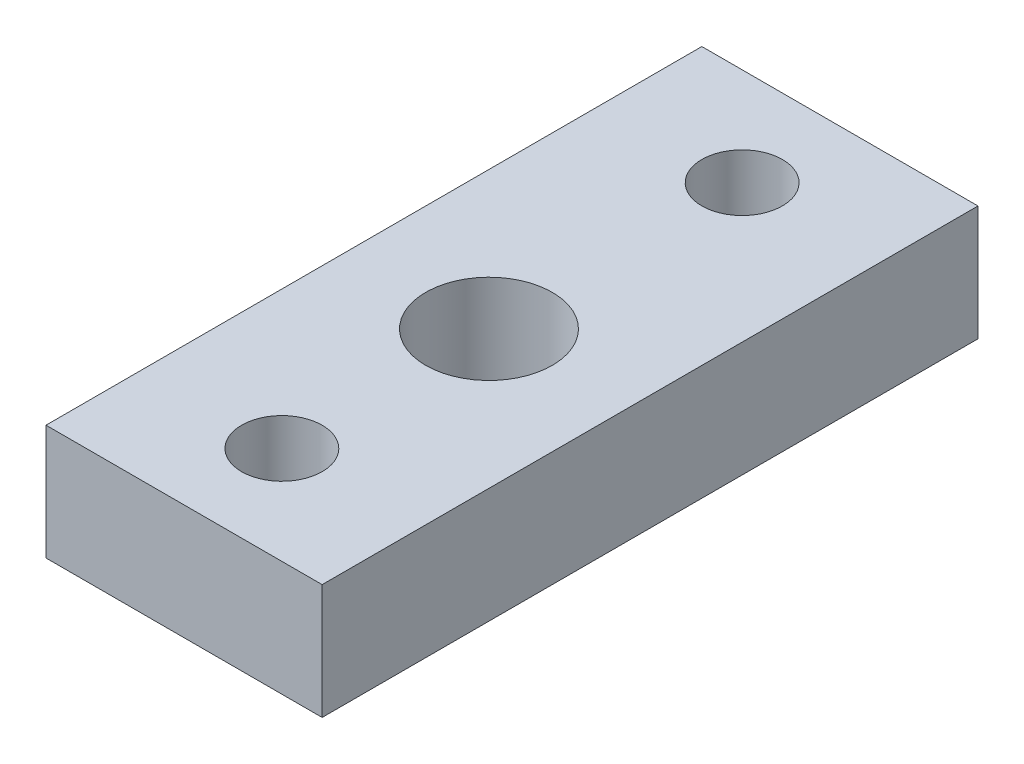
ISO-10303-21;
HEADER;
FILE_DESCRIPTION(('STEP AP214'),'2;1');
FILE_NAME('part.step','',(''),(''),'','','');
FILE_SCHEMA(('AUTOMOTIVE_DESIGN { 1 0 10303 214 1 1 1 1 }'));
ENDSEC;
DATA;
#1=APPLICATION_CONTEXT('core data for automotive mechanical design processes');
#2=APPLICATION_PROTOCOL_DEFINITION('international standard','automotive_design',2000,#1);
#3=PRODUCT_CONTEXT('',#1,'mechanical');
#4=PRODUCT('Part','Part','',(#3));
#5=PRODUCT_RELATED_PRODUCT_CATEGORY('part','',(#4));
#6=PRODUCT_DEFINITION_FORMATION('','',#4);
#7=PRODUCT_DEFINITION_CONTEXT('part definition',#1,'design');
#8=PRODUCT_DEFINITION('design','',#6,#7);
#9=PRODUCT_DEFINITION_SHAPE('','',#8);
#10=(LENGTH_UNIT() NAMED_UNIT(*) SI_UNIT(.MILLI.,.METRE.));
#11=(NAMED_UNIT(*) PLANE_ANGLE_UNIT() SI_UNIT($,.RADIAN.));
#12=(NAMED_UNIT(*) SI_UNIT($,.STERADIAN.) SOLID_ANGLE_UNIT());
#13=UNCERTAINTY_MEASURE_WITH_UNIT(LENGTH_MEASURE(1.E-05),#10,'distance_accuracy_value','');
#14=(GEOMETRIC_REPRESENTATION_CONTEXT(3) GLOBAL_UNCERTAINTY_ASSIGNED_CONTEXT((#13)) GLOBAL_UNIT_ASSIGNED_CONTEXT((#10,
#11,#12)) REPRESENTATION_CONTEXT('',''));
#15=CARTESIAN_POINT('',(0.,0.,0.));
#16=DIRECTION('',(0.,0.,1.));
#17=DIRECTION('',(1.,0.,0.));
#18=AXIS2_PLACEMENT_3D('',#15,#16,#17);
#19=CARTESIAN_POINT('',(0.,5.,0.));
#20=DIRECTION('',(0.,1.,0.));
#21=DIRECTION('',(0.,0.,1.));
#22=AXIS2_PLACEMENT_3D('',#19,#20,#21);
#23=PLANE('',#22);
#24=CARTESIAN_POINT('',(6.,5.,-4.25));
#25=DIRECTION('',(0.,1.,0.));
#26=DIRECTION('',(0.,0.,1.));
#27=AXIS2_PLACEMENT_3D('',#24,#25,#26);
#28=CIRCLE('',#27,1.75);
#29=CARTESIAN_POINT('',(6.,5.,-2.5));
#30=VERTEX_POINT('',#29);
#31=EDGE_CURVE('E116',#30,#30,#28,.T.);
#32=ORIENTED_EDGE('',*,*,#31,.F.);
#33=EDGE_LOOP('',(#32));
#34=FACE_BOUND('',#33,.T.);
#35=DIRECTION('',(1.,0.,0.));
#36=VECTOR('',#35,1.);
#37=CARTESIAN_POINT('',(0.,5.,0.));
#38=LINE('',#37,#36);
#39=CARTESIAN_POINT('',(0.,5.,0.));
#40=VERTEX_POINT('',#39);
#41=CARTESIAN_POINT('',(12.,5.,0.));
#42=VERTEX_POINT('',#41);
#43=EDGE_CURVE('E86',#40,#42,#38,.T.);
#44=ORIENTED_EDGE('',*,*,#43,.T.);
#45=DIRECTION('',(0.,0.,-1.));
#46=VECTOR('',#45,1.);
#47=CARTESIAN_POINT('',(12.,5.,0.));
#48=LINE('',#47,#46);
#49=CARTESIAN_POINT('',(12.,5.,-28.5));
#50=VERTEX_POINT('',#49);
#51=EDGE_CURVE('E81',#42,#50,#48,.T.);
#52=ORIENTED_EDGE('',*,*,#51,.T.);
#53=DIRECTION('',(-1.,0.,0.));
#54=VECTOR('',#53,1.);
#55=CARTESIAN_POINT('',(0.,5.,-28.5));
#56=LINE('',#55,#54);
#57=CARTESIAN_POINT('',(0.,5.,-28.5));
#58=VERTEX_POINT('',#57);
#59=EDGE_CURVE('E84',#50,#58,#56,.T.);
#60=ORIENTED_EDGE('',*,*,#59,.T.);
#61=DIRECTION('',(0.,0.,1.));
#62=VECTOR('',#61,1.);
#63=CARTESIAN_POINT('',(0.,5.,0.));
#64=LINE('',#63,#62);
#65=EDGE_CURVE('E51',#58,#40,#64,.T.);
#66=ORIENTED_EDGE('',*,*,#65,.T.);
#67=EDGE_LOOP('',(#44,#52,#60,#66));
#68=FACE_BOUND('',#67,.T.);
#69=CARTESIAN_POINT('',(6.,5.,-24.25));
#70=DIRECTION('',(0.,1.,0.));
#71=DIRECTION('',(0.,0.,1.));
#72=AXIS2_PLACEMENT_3D('',#69,#70,#71);
#73=CIRCLE('',#72,1.75);
#74=CARTESIAN_POINT('',(6.,5.,-22.5));
#75=VERTEX_POINT('',#74);
#76=EDGE_CURVE('E101',#75,#75,#73,.T.);
#77=ORIENTED_EDGE('',*,*,#76,.F.);
#78=EDGE_LOOP('',(#77));
#79=FACE_BOUND('',#78,.T.);
#80=CARTESIAN_POINT('',(6.,5.,-13.25));
#81=DIRECTION('',(0.,1.,0.));
#82=DIRECTION('',(0.,0.,1.));
#83=AXIS2_PLACEMENT_3D('',#80,#81,#82);
#84=CIRCLE('',#83,2.75);
#85=CARTESIAN_POINT('',(6.,5.,-10.5));
#86=VERTEX_POINT('',#85);
#87=EDGE_CURVE('E122',#86,#86,#84,.T.);
#88=ORIENTED_EDGE('',*,*,#87,.F.);
#89=EDGE_LOOP('',(#88));
#90=FACE_BOUND('',#89,.T.);
#91=ADVANCED_FACE('F34',(#34,#68,#79,#90),#23,.T.);
#92=CARTESIAN_POINT('',(0.,0.,0.));
#93=DIRECTION('',(0.,1.,0.));
#94=DIRECTION('',(0.,0.,1.));
#95=AXIS2_PLACEMENT_3D('',#92,#93,#94);
#96=PLANE('',#95);
#97=CARTESIAN_POINT('',(6.,0.,-4.25));
#98=DIRECTION('',(0.,1.,0.));
#99=DIRECTION('',(0.,0.,1.));
#100=AXIS2_PLACEMENT_3D('',#97,#98,#99);
#101=CIRCLE('',#100,1.75);
#102=CARTESIAN_POINT('',(6.,0.,-2.5));
#103=VERTEX_POINT('',#102);
#104=EDGE_CURVE('E119',#103,#103,#101,.T.);
#105=ORIENTED_EDGE('',*,*,#104,.T.);
#106=EDGE_LOOP('',(#105));
#107=FACE_BOUND('',#106,.T.);
#108=DIRECTION('',(1.,0.,0.));
#109=VECTOR('',#108,1.);
#110=CARTESIAN_POINT('',(0.,0.,0.));
#111=LINE('',#110,#109);
#112=CARTESIAN_POINT('',(0.,0.,0.));
#113=VERTEX_POINT('',#112);
#114=CARTESIAN_POINT('',(12.,0.,0.));
#115=VERTEX_POINT('',#114);
#116=EDGE_CURVE('E98',#113,#115,#111,.T.);
#117=ORIENTED_EDGE('',*,*,#116,.F.);
#118=DIRECTION('',(0.,0.,1.));
#119=VECTOR('',#118,1.);
#120=CARTESIAN_POINT('',(0.,0.,0.));
#121=LINE('',#120,#119);
#122=CARTESIAN_POINT('',(0.,0.,-28.5));
#123=VERTEX_POINT('',#122);
#124=EDGE_CURVE('E74',#123,#113,#121,.T.);
#125=ORIENTED_EDGE('',*,*,#124,.F.);
#126=DIRECTION('',(-1.,0.,0.));
#127=VECTOR('',#126,1.);
#128=CARTESIAN_POINT('',(0.,0.,-28.5));
#129=LINE('',#128,#127);
#130=CARTESIAN_POINT('',(12.,0.,-28.5));
#131=VERTEX_POINT('',#130);
#132=EDGE_CURVE('E68',#131,#123,#129,.T.);
#133=ORIENTED_EDGE('',*,*,#132,.F.);
#134=DIRECTION('',(0.,0.,-1.));
#135=VECTOR('',#134,1.);
#136=CARTESIAN_POINT('',(12.,0.,0.));
#137=LINE('',#136,#135);
#138=EDGE_CURVE('E90',#115,#131,#137,.T.);
#139=ORIENTED_EDGE('',*,*,#138,.F.);
#140=EDGE_LOOP('',(#117,#125,#133,#139));
#141=FACE_BOUND('',#140,.T.);
#142=CARTESIAN_POINT('',(6.,0.,-24.25));
#143=DIRECTION('',(0.,1.,0.));
#144=DIRECTION('',(0.,0.,1.));
#145=AXIS2_PLACEMENT_3D('',#142,#143,#144);
#146=CIRCLE('',#145,1.75);
#147=CARTESIAN_POINT('',(6.,0.,-22.5));
#148=VERTEX_POINT('',#147);
#149=EDGE_CURVE('E113',#148,#148,#146,.T.);
#150=ORIENTED_EDGE('',*,*,#149,.T.);
#151=EDGE_LOOP('',(#150));
#152=FACE_BOUND('',#151,.T.);
#153=CARTESIAN_POINT('',(6.,0.,-13.25));
#154=DIRECTION('',(0.,1.,0.));
#155=DIRECTION('',(0.,0.,1.));
#156=AXIS2_PLACEMENT_3D('',#153,#154,#155);
#157=CIRCLE('',#156,2.75);
#158=CARTESIAN_POINT('',(6.,0.,-10.5));
#159=VERTEX_POINT('',#158);
#160=EDGE_CURVE('E125',#159,#159,#157,.T.);
#161=ORIENTED_EDGE('',*,*,#160,.T.);
#162=EDGE_LOOP('',(#161));
#163=FACE_BOUND('',#162,.T.);
#164=ADVANCED_FACE('F109',(#107,#141,#152,#163),#96,.F.);
#165=CARTESIAN_POINT('',(0.,5.,0.));
#166=DIRECTION('',(0.,0.,-1.));
#167=DIRECTION('',(-1.,0.,0.));
#168=AXIS2_PLACEMENT_3D('',#165,#166,#167);
#169=PLANE('',#168);
#170=ORIENTED_EDGE('',*,*,#116,.T.);
#171=DIRECTION('',(0.,-1.,0.));
#172=VECTOR('',#171,1.);
#173=CARTESIAN_POINT('',(12.,5.,0.));
#174=LINE('',#173,#172);
#175=EDGE_CURVE('E11',#42,#115,#174,.T.);
#176=ORIENTED_EDGE('',*,*,#175,.F.);
#177=ORIENTED_EDGE('',*,*,#43,.F.);
#178=DIRECTION('',(0.,-1.,0.));
#179=VECTOR('',#178,1.);
#180=CARTESIAN_POINT('',(0.,5.,0.));
#181=LINE('',#180,#179);
#182=EDGE_CURVE('E94',#40,#113,#181,.T.);
#183=ORIENTED_EDGE('',*,*,#182,.T.);
#184=EDGE_LOOP('',(#170,#176,#177,#183));
#185=FACE_BOUND('',#184,.T.);
#186=ADVANCED_FACE('F36',(#185),#169,.F.);
#187=CARTESIAN_POINT('',(12.,5.,0.));
#188=DIRECTION('',(-1.,0.,0.));
#189=DIRECTION('',(0.,0.,1.));
#190=AXIS2_PLACEMENT_3D('',#187,#188,#189);
#191=PLANE('',#190);
#192=ORIENTED_EDGE('',*,*,#138,.T.);
#193=DIRECTION('',(0.,-1.,0.));
#194=VECTOR('',#193,1.);
#195=CARTESIAN_POINT('',(12.,5.,-28.5));
#196=LINE('',#195,#194);
#197=EDGE_CURVE('E43',#50,#131,#196,.T.);
#198=ORIENTED_EDGE('',*,*,#197,.F.);
#199=ORIENTED_EDGE('',*,*,#51,.F.);
#200=ORIENTED_EDGE('',*,*,#175,.T.);
#201=EDGE_LOOP('',(#192,#198,#199,#200));
#202=FACE_BOUND('',#201,.T.);
#203=ADVANCED_FACE('F89',(#202),#191,.F.);
#204=CARTESIAN_POINT('',(0.,5.,-28.5));
#205=DIRECTION('',(0.,0.,1.));
#206=DIRECTION('',(1.,0.,0.));
#207=AXIS2_PLACEMENT_3D('',#204,#205,#206);
#208=PLANE('',#207);
#209=ORIENTED_EDGE('',*,*,#132,.T.);
#210=DIRECTION('',(0.,-1.,0.));
#211=VECTOR('',#210,1.);
#212=CARTESIAN_POINT('',(0.,5.,-28.5));
#213=LINE('',#212,#211);
#214=EDGE_CURVE('E91',#58,#123,#213,.T.);
#215=ORIENTED_EDGE('',*,*,#214,.F.);
#216=ORIENTED_EDGE('',*,*,#59,.F.);
#217=ORIENTED_EDGE('',*,*,#197,.T.);
#218=EDGE_LOOP('',(#209,#215,#216,#217));
#219=FACE_BOUND('',#218,.T.);
#220=ADVANCED_FACE('F92',(#219),#208,.F.);
#221=CARTESIAN_POINT('',(0.,5.,0.));
#222=DIRECTION('',(1.,0.,0.));
#223=DIRECTION('',(0.,0.,-1.));
#224=AXIS2_PLACEMENT_3D('',#221,#222,#223);
#225=PLANE('',#224);
#226=ORIENTED_EDGE('',*,*,#124,.T.);
#227=ORIENTED_EDGE('',*,*,#182,.F.);
#228=ORIENTED_EDGE('',*,*,#65,.F.);
#229=ORIENTED_EDGE('',*,*,#214,.T.);
#230=EDGE_LOOP('',(#226,#227,#228,#229));
#231=FACE_BOUND('',#230,.T.);
#232=ADVANCED_FACE('F106',(#231),#225,.F.);
#233=CARTESIAN_POINT('',(6.,5.,-24.25));
#234=DIRECTION('',(0.,-1.,0.));
#235=DIRECTION('',(0.,0.,-1.));
#236=AXIS2_PLACEMENT_3D('',#233,#234,#235);
#237=CYLINDRICAL_SURFACE('',#236,1.75);
#238=ORIENTED_EDGE('',*,*,#76,.T.);
#239=EDGE_LOOP('',(#238));
#240=FACE_BOUND('',#239,.T.);
#241=ORIENTED_EDGE('',*,*,#149,.F.);
#242=EDGE_LOOP('',(#241));
#243=FACE_BOUND('',#242,.T.);
#244=ADVANCED_FACE('F144',(#240,#243),#237,.F.);
#245=CARTESIAN_POINT('',(6.,5.,-4.25));
#246=DIRECTION('',(0.,-1.,0.));
#247=DIRECTION('',(0.,0.,-1.));
#248=AXIS2_PLACEMENT_3D('',#245,#246,#247);
#249=CYLINDRICAL_SURFACE('',#248,1.75);
#250=ORIENTED_EDGE('',*,*,#31,.T.);
#251=EDGE_LOOP('',(#250));
#252=FACE_BOUND('',#251,.T.);
#253=ORIENTED_EDGE('',*,*,#104,.F.);
#254=EDGE_LOOP('',(#253));
#255=FACE_BOUND('',#254,.T.);
#256=ADVANCED_FACE('F190',(#252,#255),#249,.F.);
#257=CARTESIAN_POINT('',(6.,5.,-13.25));
#258=DIRECTION('',(0.,-1.,0.));
#259=DIRECTION('',(0.,0.,-1.));
#260=AXIS2_PLACEMENT_3D('',#257,#258,#259);
#261=CYLINDRICAL_SURFACE('',#260,2.75);
#262=ORIENTED_EDGE('',*,*,#87,.T.);
#263=EDGE_LOOP('',(#262));
#264=FACE_BOUND('',#263,.T.);
#265=ORIENTED_EDGE('',*,*,#160,.F.);
#266=EDGE_LOOP('',(#265));
#267=FACE_BOUND('',#266,.T.);
#268=ADVANCED_FACE('F131',(#264,#267),#261,.F.);
#269=CLOSED_SHELL('',(#91,#164,#186,#203,#220,#232,#244,#256,#268));
#270=MANIFOLD_SOLID_BREP('B2',#269);
#271=ADVANCED_BREP_SHAPE_REPRESENTATION('',(#18,#270),#14);
#272=SHAPE_DEFINITION_REPRESENTATION(#9,#271);
ENDSEC;
END-ISO-10303-21;
